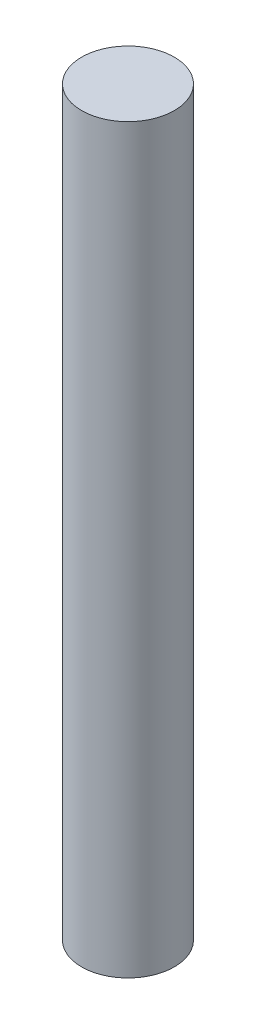
ISO-10303-21;
HEADER;
FILE_DESCRIPTION(('STEP AP214'),'2;1');
FILE_NAME('part.step','',(''),(''),'','','');
FILE_SCHEMA(('AUTOMOTIVE_DESIGN { 1 0 10303 214 1 1 1 1 }'));
ENDSEC;
DATA;
#1=APPLICATION_CONTEXT('core data for automotive mechanical design processes');
#2=APPLICATION_PROTOCOL_DEFINITION('international standard','automotive_design',2000,#1);
#3=PRODUCT_CONTEXT('',#1,'mechanical');
#4=PRODUCT('Part','Part','',(#3));
#5=PRODUCT_RELATED_PRODUCT_CATEGORY('part','',(#4));
#6=PRODUCT_DEFINITION_FORMATION('','',#4);
#7=PRODUCT_DEFINITION_CONTEXT('part definition',#1,'design');
#8=PRODUCT_DEFINITION('design','',#6,#7);
#9=PRODUCT_DEFINITION_SHAPE('','',#8);
#10=(LENGTH_UNIT() NAMED_UNIT(*) SI_UNIT(.MILLI.,.METRE.));
#11=(NAMED_UNIT(*) PLANE_ANGLE_UNIT() SI_UNIT($,.RADIAN.));
#12=(NAMED_UNIT(*) SI_UNIT($,.STERADIAN.) SOLID_ANGLE_UNIT());
#13=UNCERTAINTY_MEASURE_WITH_UNIT(LENGTH_MEASURE(1.E-05),#10,'distance_accuracy_value','');
#14=(GEOMETRIC_REPRESENTATION_CONTEXT(3) GLOBAL_UNCERTAINTY_ASSIGNED_CONTEXT((#13)) GLOBAL_UNIT_ASSIGNED_CONTEXT((#10,
#11,#12)) REPRESENTATION_CONTEXT('',''));
#15=CARTESIAN_POINT('',(0.,0.,0.));
#16=DIRECTION('',(0.,0.,1.));
#17=DIRECTION('',(1.,0.,0.));
#18=AXIS2_PLACEMENT_3D('',#15,#16,#17);
#19=CARTESIAN_POINT('',(0.,48.,0.));
#20=DIRECTION('',(0.,-1.,0.));
#21=DIRECTION('',(0.,0.,-1.));
#22=AXIS2_PLACEMENT_3D('',#19,#20,#21);
#23=CYLINDRICAL_SURFACE('',#22,3.);
#24=CARTESIAN_POINT('',(0.,48.,0.));
#25=DIRECTION('',(0.,1.,0.));
#26=DIRECTION('',(0.,0.,1.));
#27=AXIS2_PLACEMENT_3D('',#24,#25,#26);
#28=CIRCLE('',#27,3.);
#29=CARTESIAN_POINT('',(0.,48.,3.));
#30=VERTEX_POINT('',#29);
#31=EDGE_CURVE('E10',#30,#30,#28,.T.);
#32=ORIENTED_EDGE('',*,*,#31,.F.);
#33=EDGE_LOOP('',(#32));
#34=FACE_BOUND('',#33,.T.);
#35=CARTESIAN_POINT('',(0.,0.,0.));
#36=DIRECTION('',(0.,1.,0.));
#37=DIRECTION('',(0.,0.,1.));
#38=AXIS2_PLACEMENT_3D('',#35,#36,#37);
#39=CIRCLE('',#38,3.);
#40=CARTESIAN_POINT('',(0.,0.,3.));
#41=VERTEX_POINT('',#40);
#42=EDGE_CURVE('E32',#41,#41,#39,.T.);
#43=ORIENTED_EDGE('',*,*,#42,.T.);
#44=EDGE_LOOP('',(#43));
#45=FACE_BOUND('',#44,.T.);
#46=ADVANCED_FACE('F29',(#34,#45),#23,.T.);
#47=CARTESIAN_POINT('',(0.,48.,0.));
#48=DIRECTION('',(0.,1.,0.));
#49=DIRECTION('',(0.,0.,1.));
#50=AXIS2_PLACEMENT_3D('',#47,#48,#49);
#51=PLANE('',#50);
#52=ORIENTED_EDGE('',*,*,#31,.T.);
#53=EDGE_LOOP('',(#52));
#54=FACE_BOUND('',#53,.T.);
#55=ADVANCED_FACE('F44',(#54),#51,.T.);
#56=CARTESIAN_POINT('',(0.,0.,0.));
#57=DIRECTION('',(0.,1.,0.));
#58=DIRECTION('',(0.,0.,1.));
#59=AXIS2_PLACEMENT_3D('',#56,#57,#58);
#60=PLANE('',#59);
#61=ORIENTED_EDGE('',*,*,#42,.F.);
#62=EDGE_LOOP('',(#61));
#63=FACE_BOUND('',#62,.T.);
#64=ADVANCED_FACE('F42',(#63),#60,.F.);
#65=CLOSED_SHELL('',(#46,#55,#64));
#66=MANIFOLD_SOLID_BREP('B2',#65);
#67=ADVANCED_BREP_SHAPE_REPRESENTATION('',(#18,#66),#14);
#68=SHAPE_DEFINITION_REPRESENTATION(#9,#67);
ENDSEC;
END-ISO-10303-21;
